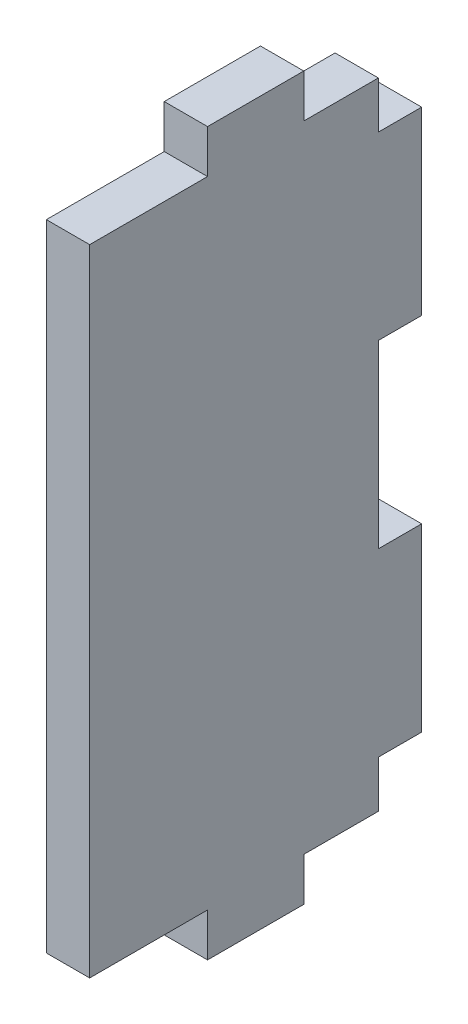
ISO-10303-21;
HEADER;
FILE_DESCRIPTION(('STEP AP214'),'2;1');
FILE_NAME('part.step','',(''),(''),'','','');
FILE_SCHEMA(('AUTOMOTIVE_DESIGN { 1 0 10303 214 1 1 1 1 }'));
ENDSEC;
DATA;
#1=APPLICATION_CONTEXT('core data for automotive mechanical design processes');
#2=APPLICATION_PROTOCOL_DEFINITION('international standard','automotive_design',2000,#1);
#3=PRODUCT_CONTEXT('',#1,'mechanical');
#4=PRODUCT('Part','Part','',(#3));
#5=PRODUCT_RELATED_PRODUCT_CATEGORY('part','',(#4));
#6=PRODUCT_DEFINITION_FORMATION('','',#4);
#7=PRODUCT_DEFINITION_CONTEXT('part definition',#1,'design');
#8=PRODUCT_DEFINITION('design','',#6,#7);
#9=PRODUCT_DEFINITION_SHAPE('','',#8);
#10=(LENGTH_UNIT() NAMED_UNIT(*) SI_UNIT(.MILLI.,.METRE.));
#11=(NAMED_UNIT(*) PLANE_ANGLE_UNIT() SI_UNIT($,.RADIAN.));
#12=(NAMED_UNIT(*) SI_UNIT($,.STERADIAN.) SOLID_ANGLE_UNIT());
#13=UNCERTAINTY_MEASURE_WITH_UNIT(LENGTH_MEASURE(1.E-05),#10,'distance_accuracy_value','');
#14=(GEOMETRIC_REPRESENTATION_CONTEXT(3) GLOBAL_UNCERTAINTY_ASSIGNED_CONTEXT((#13)) GLOBAL_UNIT_ASSIGNED_CONTEXT((#10,
#11,#12)) REPRESENTATION_CONTEXT('',''));
#15=CARTESIAN_POINT('',(0.,0.,0.));
#16=DIRECTION('',(0.,0.,1.));
#17=DIRECTION('',(1.,0.,0.));
#18=AXIS2_PLACEMENT_3D('',#15,#16,#17);
#19=CARTESIAN_POINT('',(0.,75.,69.));
#20=DIRECTION('',(0.,-1.,0.));
#21=DIRECTION('',(0.,0.,-1.));
#22=AXIS2_PLACEMENT_3D('',#19,#20,#21);
#23=PLANE('',#22);
#24=DIRECTION('',(0.,0.,-1.));
#25=VECTOR('',#24,1.);
#26=CARTESIAN_POINT('',(140.,75.,69.));
#27=LINE('',#26,#25);
#28=CARTESIAN_POINT('',(140.,75.,44.5));
#29=VERTEX_POINT('',#28);
#30=CARTESIAN_POINT('',(140.,75.,24.5));
#31=VERTEX_POINT('',#30);
#32=EDGE_CURVE('E188',#29,#31,#27,.T.);
#33=ORIENTED_EDGE('',*,*,#32,.T.);
#34=DIRECTION('',(1.,0.,0.));
#35=VECTOR('',#34,1.);
#36=CARTESIAN_POINT('',(-250.,75.,24.5));
#37=LINE('',#36,#35);
#38=CARTESIAN_POINT('',(131.,75.,24.5));
#39=VERTEX_POINT('',#38);
#40=EDGE_CURVE('E253',#39,#31,#37,.T.);
#41=ORIENTED_EDGE('',*,*,#40,.F.);
#42=DIRECTION('',(0.,0.,-1.));
#43=VECTOR('',#42,1.);
#44=CARTESIAN_POINT('',(131.,75.,69.));
#45=LINE('',#44,#43);
#46=CARTESIAN_POINT('',(131.,75.,44.5));
#47=VERTEX_POINT('',#46);
#48=EDGE_CURVE('E190',#47,#39,#45,.T.);
#49=ORIENTED_EDGE('',*,*,#48,.F.);
#50=DIRECTION('',(1.,0.,0.));
#51=VECTOR('',#50,1.);
#52=CARTESIAN_POINT('',(-250.,75.,44.5));
#53=LINE('',#52,#51);
#54=EDGE_CURVE('E175',#47,#29,#53,.T.);
#55=ORIENTED_EDGE('',*,*,#54,.T.);
#56=EDGE_LOOP('',(#33,#41,#49,#55));
#57=FACE_BOUND('',#56,.T.);
#58=ADVANCED_FACE('F35',(#57),#23,.F.);
#59=CARTESIAN_POINT('',(140.,0.,69.));
#60=DIRECTION('',(1.,0.,0.));
#61=DIRECTION('',(0.,0.,1.));
#62=AXIS2_PLACEMENT_3D('',#59,#60,#61);
#63=PLANE('',#62);
#64=DIRECTION('',(0.,1.,0.));
#65=VECTOR('',#64,1.);
#66=CARTESIAN_POINT('',(140.,0.,9.));
#67=LINE('',#66,#65);
#68=CARTESIAN_POINT('',(140.,-66.,9.));
#69=VERTEX_POINT('',#68);
#70=CARTESIAN_POINT('',(140.,-56.25,9.));
#71=VERTEX_POINT('',#70);
#72=EDGE_CURVE('E325',#69,#71,#67,.T.);
#73=ORIENTED_EDGE('',*,*,#72,.T.);
#74=DIRECTION('',(0.,0.,-1.));
#75=VECTOR('',#74,1.);
#76=CARTESIAN_POINT('',(140.,-56.25,47.5648803965473));
#77=LINE('',#76,#75);
#78=CARTESIAN_POINT('',(140.,-56.25,0.));
#79=VERTEX_POINT('',#78);
#80=EDGE_CURVE('E288',#71,#79,#77,.T.);
#81=ORIENTED_EDGE('',*,*,#80,.T.);
#82=DIRECTION('',(0.,-1.,0.));
#83=VECTOR('',#82,1.);
#84=CARTESIAN_POINT('',(140.,0.,0.));
#85=LINE('',#84,#83);
#86=CARTESIAN_POINT('',(140.,-18.75,0.));
#87=VERTEX_POINT('',#86);
#88=EDGE_CURVE('E274',#87,#79,#85,.T.);
#89=ORIENTED_EDGE('',*,*,#88,.F.);
#90=DIRECTION('',(0.,0.,-1.));
#91=VECTOR('',#90,1.);
#92=CARTESIAN_POINT('',(140.,-18.75,47.5648803965473));
#93=LINE('',#92,#91);
#94=CARTESIAN_POINT('',(140.,-18.75,9.));
#95=VERTEX_POINT('',#94);
#96=EDGE_CURVE('E270',#95,#87,#93,.T.);
#97=ORIENTED_EDGE('',*,*,#96,.F.);
#98=CARTESIAN_POINT('',(140.,18.75,9.00000000000001));
#99=VERTEX_POINT('',#98);
#100=EDGE_CURVE('E328',#95,#99,#67,.T.);
#101=ORIENTED_EDGE('',*,*,#100,.T.);
#102=DIRECTION('',(0.,0.,-1.));
#103=VECTOR('',#102,1.);
#104=CARTESIAN_POINT('',(140.,18.75,47.5648803965473));
#105=LINE('',#104,#103);
#106=CARTESIAN_POINT('',(140.,18.75,0.));
#107=VERTEX_POINT('',#106);
#108=EDGE_CURVE('E309',#99,#107,#105,.T.);
#109=ORIENTED_EDGE('',*,*,#108,.T.);
#110=DIRECTION('',(0.,-1.,0.));
#111=VECTOR('',#110,1.);
#112=CARTESIAN_POINT('',(140.,0.,0.));
#113=LINE('',#112,#111);
#114=CARTESIAN_POINT('',(140.,56.25,0.));
#115=VERTEX_POINT('',#114);
#116=EDGE_CURVE('E301',#115,#107,#113,.T.);
#117=ORIENTED_EDGE('',*,*,#116,.F.);
#118=DIRECTION('',(0.,0.,-1.));
#119=VECTOR('',#118,1.);
#120=CARTESIAN_POINT('',(140.,56.25,47.5648803965473));
#121=LINE('',#120,#119);
#122=CARTESIAN_POINT('',(140.,56.25,9.));
#123=VERTEX_POINT('',#122);
#124=EDGE_CURVE('E312',#123,#115,#121,.T.);
#125=ORIENTED_EDGE('',*,*,#124,.F.);
#126=CARTESIAN_POINT('',(140.,66.,9.));
#127=VERTEX_POINT('',#126);
#128=EDGE_CURVE('E295',#123,#127,#67,.T.);
#129=ORIENTED_EDGE('',*,*,#128,.T.);
#130=DIRECTION('',(0.,0.,1.));
#131=VECTOR('',#130,1.);
#132=CARTESIAN_POINT('',(140.,66.,0.));
#133=LINE('',#132,#131);
#134=CARTESIAN_POINT('',(140.,66.,24.5));
#135=VERTEX_POINT('',#134);
#136=EDGE_CURVE('E251',#127,#135,#133,.T.);
#137=ORIENTED_EDGE('',*,*,#136,.T.);
#138=DIRECTION('',(0.,-1.,0.));
#139=VECTOR('',#138,1.);
#140=CARTESIAN_POINT('',(140.,0.,24.5));
#141=LINE('',#140,#139);
#142=EDGE_CURVE('E195',#31,#135,#141,.T.);
#143=ORIENTED_EDGE('',*,*,#142,.F.);
#144=ORIENTED_EDGE('',*,*,#32,.F.);
#145=DIRECTION('',(0.,-1.,0.));
#146=VECTOR('',#145,1.);
#147=CARTESIAN_POINT('',(140.,0.,44.5));
#148=LINE('',#147,#146);
#149=CARTESIAN_POINT('',(140.,66.,44.5));
#150=VERTEX_POINT('',#149);
#151=EDGE_CURVE('E171',#29,#150,#148,.T.);
#152=ORIENTED_EDGE('',*,*,#151,.T.);
#153=DIRECTION('',(0.,0.,1.));
#154=VECTOR('',#153,1.);
#155=CARTESIAN_POINT('',(140.,66.,0.));
#156=LINE('',#155,#154);
#157=CARTESIAN_POINT('',(140.,66.,69.));
#158=VERTEX_POINT('',#157);
#159=EDGE_CURVE('E182',#150,#158,#156,.T.);
#160=ORIENTED_EDGE('',*,*,#159,.T.);
#161=DIRECTION('',(0.,1.,0.));
#162=VECTOR('',#161,1.);
#163=CARTESIAN_POINT('',(140.,0.,69.));
#164=LINE('',#163,#162);
#165=CARTESIAN_POINT('',(140.,-66.,69.));
#166=VERTEX_POINT('',#165);
#167=EDGE_CURVE('E319',#166,#158,#164,.T.);
#168=ORIENTED_EDGE('',*,*,#167,.F.);
#169=DIRECTION('',(0.,0.,1.));
#170=VECTOR('',#169,1.);
#171=CARTESIAN_POINT('',(140.,-66.,0.));
#172=LINE('',#171,#170);
#173=CARTESIAN_POINT('',(140.,-66.,44.5));
#174=VERTEX_POINT('',#173);
#175=EDGE_CURVE('E248',#174,#166,#172,.T.);
#176=ORIENTED_EDGE('',*,*,#175,.F.);
#177=DIRECTION('',(0.,1.,0.));
#178=VECTOR('',#177,1.);
#179=CARTESIAN_POINT('',(140.,0.,44.5));
#180=LINE('',#179,#178);
#181=CARTESIAN_POINT('',(140.,-75.,44.5));
#182=VERTEX_POINT('',#181);
#183=EDGE_CURVE('E234',#182,#174,#180,.T.);
#184=ORIENTED_EDGE('',*,*,#183,.F.);
#185=DIRECTION('',(0.,0.,-1.));
#186=VECTOR('',#185,1.);
#187=CARTESIAN_POINT('',(140.,-75.,69.));
#188=LINE('',#187,#186);
#189=CARTESIAN_POINT('',(140.,-75.,24.5));
#190=VERTEX_POINT('',#189);
#191=EDGE_CURVE('E198',#182,#190,#188,.T.);
#192=ORIENTED_EDGE('',*,*,#191,.T.);
#193=DIRECTION('',(0.,1.,0.));
#194=VECTOR('',#193,1.);
#195=CARTESIAN_POINT('',(140.,0.,24.5));
#196=LINE('',#195,#194);
#197=CARTESIAN_POINT('',(140.,-66.,24.5));
#198=VERTEX_POINT('',#197);
#199=EDGE_CURVE('E239',#190,#198,#196,.T.);
#200=ORIENTED_EDGE('',*,*,#199,.T.);
#201=DIRECTION('',(0.,0.,1.));
#202=VECTOR('',#201,1.);
#203=CARTESIAN_POINT('',(140.,-66.,0.));
#204=LINE('',#203,#202);
#205=EDGE_CURVE('E242',#69,#198,#204,.T.);
#206=ORIENTED_EDGE('',*,*,#205,.F.);
#207=EDGE_LOOP('',(#73,#81,#89,#97,#101,#109,#117,#125,#129,#137,#143,#144,#152,#160,#168,#176,
#184,#192,#200,#206));
#208=FACE_BOUND('',#207,.T.);
#209=ADVANCED_FACE('F193',(#208),#63,.T.);
#210=CARTESIAN_POINT('',(0.,-75.,69.));
#211=DIRECTION('',(0.,-1.,0.));
#212=DIRECTION('',(0.,0.,-1.));
#213=AXIS2_PLACEMENT_3D('',#210,#211,#212);
#214=PLANE('',#213);
#215=DIRECTION('',(1.,0.,0.));
#216=VECTOR('',#215,1.);
#217=CARTESIAN_POINT('',(-250.,-75.,24.5));
#218=LINE('',#217,#216);
#219=CARTESIAN_POINT('',(131.,-75.,24.5));
#220=VERTEX_POINT('',#219);
#221=EDGE_CURVE('E245',#220,#190,#218,.T.);
#222=ORIENTED_EDGE('',*,*,#221,.T.);
#223=ORIENTED_EDGE('',*,*,#191,.F.);
#224=DIRECTION('',(1.,0.,0.));
#225=VECTOR('',#224,1.);
#226=CARTESIAN_POINT('',(-250.,-75.,44.5));
#227=LINE('',#226,#225);
#228=CARTESIAN_POINT('',(131.,-75.,44.5));
#229=VERTEX_POINT('',#228);
#230=EDGE_CURVE('E183',#229,#182,#227,.T.);
#231=ORIENTED_EDGE('',*,*,#230,.F.);
#232=DIRECTION('',(0.,0.,-1.));
#233=VECTOR('',#232,1.);
#234=CARTESIAN_POINT('',(131.,-75.,69.));
#235=LINE('',#234,#233);
#236=EDGE_CURVE('E203',#229,#220,#235,.T.);
#237=ORIENTED_EDGE('',*,*,#236,.T.);
#238=EDGE_LOOP('',(#222,#223,#231,#237));
#239=FACE_BOUND('',#238,.T.);
#240=ADVANCED_FACE('F231',(#239),#214,.T.);
#241=CARTESIAN_POINT('',(131.,0.,69.));
#242=DIRECTION('',(-1.,0.,0.));
#243=DIRECTION('',(0.,0.,-1.));
#244=AXIS2_PLACEMENT_3D('',#241,#242,#243);
#245=PLANE('',#244);
#246=DIRECTION('',(0.,-1.,0.));
#247=VECTOR('',#246,1.);
#248=CARTESIAN_POINT('',(131.,0.,24.5));
#249=LINE('',#248,#247);
#250=CARTESIAN_POINT('',(131.,-66.,24.5));
#251=VERTEX_POINT('',#250);
#252=EDGE_CURVE('E11',#251,#220,#249,.T.);
#253=ORIENTED_EDGE('',*,*,#252,.T.);
#254=ORIENTED_EDGE('',*,*,#236,.F.);
#255=DIRECTION('',(0.,-1.,0.));
#256=VECTOR('',#255,1.);
#257=CARTESIAN_POINT('',(131.,0.,44.5));
#258=LINE('',#257,#256);
#259=CARTESIAN_POINT('',(131.,-66.,44.5));
#260=VERTEX_POINT('',#259);
#261=EDGE_CURVE('E42',#260,#229,#258,.T.);
#262=ORIENTED_EDGE('',*,*,#261,.F.);
#263=DIRECTION('',(0.,0.,-1.));
#264=VECTOR('',#263,1.);
#265=CARTESIAN_POINT('',(131.,-66.,68.9999999999999));
#266=LINE('',#265,#264);
#267=CARTESIAN_POINT('',(131.,-66.,69.));
#268=VERTEX_POINT('',#267);
#269=EDGE_CURVE('E262',#268,#260,#266,.T.);
#270=ORIENTED_EDGE('',*,*,#269,.F.);
#271=DIRECTION('',(0.,-1.,0.));
#272=VECTOR('',#271,1.);
#273=CARTESIAN_POINT('',(131.,0.,69.));
#274=LINE('',#273,#272);
#275=CARTESIAN_POINT('',(131.,66.,69.));
#276=VERTEX_POINT('',#275);
#277=EDGE_CURVE('E322',#276,#268,#274,.T.);
#278=ORIENTED_EDGE('',*,*,#277,.F.);
#279=DIRECTION('',(0.,0.,-1.));
#280=VECTOR('',#279,1.);
#281=CARTESIAN_POINT('',(131.,66.,69.));
#282=LINE('',#281,#280);
#283=CARTESIAN_POINT('',(131.,66.,44.5));
#284=VERTEX_POINT('',#283);
#285=EDGE_CURVE('E259',#276,#284,#282,.T.);
#286=ORIENTED_EDGE('',*,*,#285,.T.);
#287=DIRECTION('',(0.,1.,0.));
#288=VECTOR('',#287,1.);
#289=CARTESIAN_POINT('',(131.,0.,44.5));
#290=LINE('',#289,#288);
#291=EDGE_CURVE('E214',#284,#47,#290,.T.);
#292=ORIENTED_EDGE('',*,*,#291,.T.);
#293=ORIENTED_EDGE('',*,*,#48,.T.);
#294=DIRECTION('',(0.,1.,0.));
#295=VECTOR('',#294,1.);
#296=CARTESIAN_POINT('',(131.,0.,24.5));
#297=LINE('',#296,#295);
#298=CARTESIAN_POINT('',(131.,66.,24.5));
#299=VERTEX_POINT('',#298);
#300=EDGE_CURVE('E212',#299,#39,#297,.T.);
#301=ORIENTED_EDGE('',*,*,#300,.F.);
#302=DIRECTION('',(0.,0.,-1.));
#303=VECTOR('',#302,1.);
#304=CARTESIAN_POINT('',(131.,66.,69.));
#305=LINE('',#304,#303);
#306=CARTESIAN_POINT('',(131.,66.,9.));
#307=VERTEX_POINT('',#306);
#308=EDGE_CURVE('E209',#299,#307,#305,.T.);
#309=ORIENTED_EDGE('',*,*,#308,.T.);
#310=DIRECTION('',(0.,-1.,0.));
#311=VECTOR('',#310,1.);
#312=CARTESIAN_POINT('',(131.,0.,9.));
#313=LINE('',#312,#311);
#314=CARTESIAN_POINT('',(131.,56.25,9.));
#315=VERTEX_POINT('',#314);
#316=EDGE_CURVE('E323',#307,#315,#313,.T.);
#317=ORIENTED_EDGE('',*,*,#316,.T.);
#318=DIRECTION('',(0.,0.,-1.));
#319=VECTOR('',#318,1.);
#320=CARTESIAN_POINT('',(131.,56.25,47.5648803965473));
#321=LINE('',#320,#319);
#322=CARTESIAN_POINT('',(131.,56.25,0.));
#323=VERTEX_POINT('',#322);
#324=EDGE_CURVE('E315',#315,#323,#321,.T.);
#325=ORIENTED_EDGE('',*,*,#324,.T.);
#326=DIRECTION('',(0.,-1.,0.));
#327=VECTOR('',#326,1.);
#328=CARTESIAN_POINT('',(131.,0.,0.));
#329=LINE('',#328,#327);
#330=CARTESIAN_POINT('',(131.,18.75,0.));
#331=VERTEX_POINT('',#330);
#332=EDGE_CURVE('E272',#323,#331,#329,.T.);
#333=ORIENTED_EDGE('',*,*,#332,.T.);
#334=DIRECTION('',(0.,0.,-1.));
#335=VECTOR('',#334,1.);
#336=CARTESIAN_POINT('',(131.,18.75,47.5648803965473));
#337=LINE('',#336,#335);
#338=CARTESIAN_POINT('',(131.,18.75,9.));
#339=VERTEX_POINT('',#338);
#340=EDGE_CURVE('E306',#339,#331,#337,.T.);
#341=ORIENTED_EDGE('',*,*,#340,.F.);
#342=CARTESIAN_POINT('',(131.,-18.75,9.));
#343=VERTEX_POINT('',#342);
#344=EDGE_CURVE('E331',#339,#343,#313,.T.);
#345=ORIENTED_EDGE('',*,*,#344,.T.);
#346=DIRECTION('',(0.,0.,-1.));
#347=VECTOR('',#346,1.);
#348=CARTESIAN_POINT('',(131.,-18.75,47.5648803965473));
#349=LINE('',#348,#347);
#350=CARTESIAN_POINT('',(131.,-18.75,0.));
#351=VERTEX_POINT('',#350);
#352=EDGE_CURVE('E282',#343,#351,#349,.T.);
#353=ORIENTED_EDGE('',*,*,#352,.T.);
#354=DIRECTION('',(0.,-1.,0.));
#355=VECTOR('',#354,1.);
#356=CARTESIAN_POINT('',(131.,0.,0.));
#357=LINE('',#356,#355);
#358=CARTESIAN_POINT('',(131.,-56.25,0.));
#359=VERTEX_POINT('',#358);
#360=EDGE_CURVE('E279',#351,#359,#357,.T.);
#361=ORIENTED_EDGE('',*,*,#360,.T.);
#362=DIRECTION('',(0.,0.,-1.));
#363=VECTOR('',#362,1.);
#364=CARTESIAN_POINT('',(131.,-56.25,47.5648803965473));
#365=LINE('',#364,#363);
#366=CARTESIAN_POINT('',(131.,-56.25,9.00000000000001));
#367=VERTEX_POINT('',#366);
#368=EDGE_CURVE('E285',#367,#359,#365,.T.);
#369=ORIENTED_EDGE('',*,*,#368,.F.);
#370=CARTESIAN_POINT('',(131.,-66.,9.));
#371=VERTEX_POINT('',#370);
#372=EDGE_CURVE('E327',#367,#371,#313,.T.);
#373=ORIENTED_EDGE('',*,*,#372,.T.);
#374=DIRECTION('',(0.,0.,-1.));
#375=VECTOR('',#374,1.);
#376=CARTESIAN_POINT('',(131.,-66.,69.));
#377=LINE('',#376,#375);
#378=EDGE_CURVE('E255',#251,#371,#377,.T.);
#379=ORIENTED_EDGE('',*,*,#378,.F.);
#380=EDGE_LOOP('',(#253,#254,#262,#270,#278,#286,#292,#293,#301,#309,#317,#325,#333,#341,#345,
#353,#361,#369,#373,#379));
#381=FACE_BOUND('',#380,.T.);
#382=ADVANCED_FACE('F226',(#381),#245,.T.);
#383=CARTESIAN_POINT('',(0.,0.,69.));
#384=DIRECTION('',(0.,0.,-1.));
#385=DIRECTION('',(1.,0.,0.));
#386=AXIS2_PLACEMENT_3D('',#383,#384,#385);
#387=PLANE('',#386);
#388=DIRECTION('',(1.,0.,0.));
#389=VECTOR('',#388,1.);
#390=CARTESIAN_POINT('',(0.,-66.,69.));
#391=LINE('',#390,#389);
#392=EDGE_CURVE('E57',#268,#166,#391,.T.);
#393=ORIENTED_EDGE('',*,*,#392,.T.);
#394=ORIENTED_EDGE('',*,*,#167,.T.);
#395=DIRECTION('',(1.,0.,0.));
#396=VECTOR('',#395,1.);
#397=CARTESIAN_POINT('',(0.,66.,69.));
#398=LINE('',#397,#396);
#399=EDGE_CURVE('E200',#276,#158,#398,.T.);
#400=ORIENTED_EDGE('',*,*,#399,.F.);
#401=ORIENTED_EDGE('',*,*,#277,.T.);
#402=EDGE_LOOP('',(#393,#394,#400,#401));
#403=FACE_BOUND('',#402,.T.);
#404=ADVANCED_FACE('F383',(#403),#387,.F.);
#405=CARTESIAN_POINT('',(0.,0.,9.));
#406=DIRECTION('',(0.,0.,-1.));
#407=DIRECTION('',(1.,0.,0.));
#408=AXIS2_PLACEMENT_3D('',#405,#406,#407);
#409=PLANE('',#408);
#410=ORIENTED_EDGE('',*,*,#372,.F.);
#411=DIRECTION('',(-1.,0.,0.));
#412=VECTOR('',#411,1.);
#413=CARTESIAN_POINT('',(0.,-56.25,9.));
#414=LINE('',#413,#412);
#415=EDGE_CURVE('E267',#71,#367,#414,.T.);
#416=ORIENTED_EDGE('',*,*,#415,.F.);
#417=ORIENTED_EDGE('',*,*,#72,.F.);
#418=DIRECTION('',(1.,0.,0.));
#419=VECTOR('',#418,1.);
#420=CARTESIAN_POINT('',(0.,-66.,9.));
#421=LINE('',#420,#419);
#422=EDGE_CURVE('E197',#371,#69,#421,.T.);
#423=ORIENTED_EDGE('',*,*,#422,.F.);
#424=EDGE_LOOP('',(#410,#416,#417,#423));
#425=FACE_BOUND('',#424,.T.);
#426=ADVANCED_FACE('F365',(#425),#409,.T.);
#427=DIRECTION('',(1.,0.,0.));
#428=VECTOR('',#427,1.);
#429=CARTESIAN_POINT('',(0.,-18.75,9.));
#430=LINE('',#429,#428);
#431=EDGE_CURVE('E269',#343,#95,#430,.T.);
#432=ORIENTED_EDGE('',*,*,#431,.F.);
#433=ORIENTED_EDGE('',*,*,#344,.F.);
#434=DIRECTION('',(1.,0.,0.));
#435=VECTOR('',#434,1.);
#436=CARTESIAN_POINT('',(0.,18.75,9.));
#437=LINE('',#436,#435);
#438=EDGE_CURVE('E296',#339,#99,#437,.T.);
#439=ORIENTED_EDGE('',*,*,#438,.T.);
#440=ORIENTED_EDGE('',*,*,#100,.F.);
#441=EDGE_LOOP('',(#432,#433,#439,#440));
#442=FACE_BOUND('',#441,.T.);
#443=ADVANCED_FACE('F359',(#442),#409,.T.);
#444=DIRECTION('',(1.,0.,0.));
#445=VECTOR('',#444,1.);
#446=CARTESIAN_POINT('',(0.,66.,9.));
#447=LINE('',#446,#445);
#448=EDGE_CURVE('E264',#307,#127,#447,.T.);
#449=ORIENTED_EDGE('',*,*,#448,.T.);
#450=ORIENTED_EDGE('',*,*,#128,.F.);
#451=DIRECTION('',(-1.,0.,0.));
#452=VECTOR('',#451,1.);
#453=CARTESIAN_POINT('',(0.,56.25,9.));
#454=LINE('',#453,#452);
#455=EDGE_CURVE('E293',#123,#315,#454,.T.);
#456=ORIENTED_EDGE('',*,*,#455,.T.);
#457=ORIENTED_EDGE('',*,*,#316,.F.);
#458=EDGE_LOOP('',(#449,#450,#456,#457));
#459=FACE_BOUND('',#458,.T.);
#460=ADVANCED_FACE('F343',(#459),#409,.T.);
#461=CARTESIAN_POINT('',(0.,0.,0.));
#462=DIRECTION('',(0.,0.,1.));
#463=DIRECTION('',(-1.,0.,0.));
#464=AXIS2_PLACEMENT_3D('',#461,#462,#463);
#465=PLANE('',#464);
#466=ORIENTED_EDGE('',*,*,#332,.F.);
#467=DIRECTION('',(1.,0.,0.));
#468=VECTOR('',#467,1.);
#469=CARTESIAN_POINT('',(0.,56.25,0.));
#470=LINE('',#469,#468);
#471=EDGE_CURVE('E299',#323,#115,#470,.T.);
#472=ORIENTED_EDGE('',*,*,#471,.T.);
#473=ORIENTED_EDGE('',*,*,#116,.T.);
#474=DIRECTION('',(-1.,0.,0.));
#475=VECTOR('',#474,1.);
#476=CARTESIAN_POINT('',(0.,18.75,0.));
#477=LINE('',#476,#475);
#478=EDGE_CURVE('E304',#107,#331,#477,.T.);
#479=ORIENTED_EDGE('',*,*,#478,.T.);
#480=EDGE_LOOP('',(#466,#472,#473,#479));
#481=FACE_BOUND('',#480,.T.);
#482=ADVANCED_FACE('F349',(#481),#465,.F.);
#483=CARTESIAN_POINT('',(0.,18.75,47.5648803965473));
#484=DIRECTION('',(0.,1.,0.));
#485=DIRECTION('',(0.,0.,1.));
#486=AXIS2_PLACEMENT_3D('',#483,#484,#485);
#487=PLANE('',#486);
#488=ORIENTED_EDGE('',*,*,#340,.T.);
#489=ORIENTED_EDGE('',*,*,#478,.F.);
#490=ORIENTED_EDGE('',*,*,#108,.F.);
#491=ORIENTED_EDGE('',*,*,#438,.F.);
#492=EDGE_LOOP('',(#488,#489,#490,#491));
#493=FACE_BOUND('',#492,.T.);
#494=ADVANCED_FACE('F354',(#493),#487,.F.);
#495=CARTESIAN_POINT('',(0.,56.25,47.5648803965473));
#496=DIRECTION('',(0.,-1.,0.));
#497=DIRECTION('',(0.,0.,-1.));
#498=AXIS2_PLACEMENT_3D('',#495,#496,#497);
#499=PLANE('',#498);
#500=ORIENTED_EDGE('',*,*,#124,.T.);
#501=ORIENTED_EDGE('',*,*,#471,.F.);
#502=ORIENTED_EDGE('',*,*,#324,.F.);
#503=ORIENTED_EDGE('',*,*,#455,.F.);
#504=EDGE_LOOP('',(#500,#501,#502,#503));
#505=FACE_BOUND('',#504,.T.);
#506=ADVANCED_FACE('F345',(#505),#499,.F.);
#507=CARTESIAN_POINT('',(0.,-18.75,47.5648803965473));
#508=DIRECTION('',(0.,1.,0.));
#509=DIRECTION('',(0.,0.,1.));
#510=AXIS2_PLACEMENT_3D('',#507,#508,#509);
#511=PLANE('',#510);
#512=ORIENTED_EDGE('',*,*,#431,.T.);
#513=ORIENTED_EDGE('',*,*,#96,.T.);
#514=DIRECTION('',(-1.,0.,0.));
#515=VECTOR('',#514,1.);
#516=CARTESIAN_POINT('',(0.,-18.75,0.));
#517=LINE('',#516,#515);
#518=EDGE_CURVE('E266',#87,#351,#517,.T.);
#519=ORIENTED_EDGE('',*,*,#518,.T.);
#520=ORIENTED_EDGE('',*,*,#352,.F.);
#521=EDGE_LOOP('',(#512,#513,#519,#520));
#522=FACE_BOUND('',#521,.T.);
#523=ADVANCED_FACE('F411',(#522),#511,.T.);
#524=CARTESIAN_POINT('',(0.,-56.25,47.5648803965473));
#525=DIRECTION('',(0.,-1.,0.));
#526=DIRECTION('',(0.,0.,-1.));
#527=AXIS2_PLACEMENT_3D('',#524,#525,#526);
#528=PLANE('',#527);
#529=ORIENTED_EDGE('',*,*,#415,.T.);
#530=ORIENTED_EDGE('',*,*,#368,.T.);
#531=DIRECTION('',(1.,0.,0.));
#532=VECTOR('',#531,1.);
#533=CARTESIAN_POINT('',(0.,-56.25,0.));
#534=LINE('',#533,#532);
#535=EDGE_CURVE('E277',#359,#79,#534,.T.);
#536=ORIENTED_EDGE('',*,*,#535,.T.);
#537=ORIENTED_EDGE('',*,*,#80,.F.);
#538=EDGE_LOOP('',(#529,#530,#536,#537));
#539=FACE_BOUND('',#538,.T.);
#540=ADVANCED_FACE('F418',(#539),#528,.T.);
#541=CARTESIAN_POINT('',(0.,0.,0.));
#542=DIRECTION('',(0.,0.,1.));
#543=DIRECTION('',(-1.,0.,0.));
#544=AXIS2_PLACEMENT_3D('',#541,#542,#543);
#545=PLANE('',#544);
#546=ORIENTED_EDGE('',*,*,#518,.F.);
#547=ORIENTED_EDGE('',*,*,#88,.T.);
#548=ORIENTED_EDGE('',*,*,#535,.F.);
#549=ORIENTED_EDGE('',*,*,#360,.F.);
#550=EDGE_LOOP('',(#546,#547,#548,#549));
#551=FACE_BOUND('',#550,.T.);
#552=ADVANCED_FACE('F422',(#551),#545,.F.);
#553=CARTESIAN_POINT('',(-250.,-66.,0.));
#554=DIRECTION('',(0.,-1.,0.));
#555=DIRECTION('',(0.,0.,-1.));
#556=AXIS2_PLACEMENT_3D('',#553,#554,#555);
#557=PLANE('',#556);
#558=DIRECTION('',(1.,0.,0.));
#559=VECTOR('',#558,1.);
#560=CARTESIAN_POINT('',(-250.,-66.,24.5));
#561=LINE('',#560,#559);
#562=EDGE_CURVE('E246',#251,#198,#561,.T.);
#563=ORIENTED_EDGE('',*,*,#562,.F.);
#564=ORIENTED_EDGE('',*,*,#378,.T.);
#565=ORIENTED_EDGE('',*,*,#422,.T.);
#566=ORIENTED_EDGE('',*,*,#205,.T.);
#567=EDGE_LOOP('',(#563,#564,#565,#566));
#568=FACE_BOUND('',#567,.T.);
#569=ADVANCED_FACE('F370',(#568),#557,.T.);
#570=CARTESIAN_POINT('',(-250.,0.,24.5));
#571=DIRECTION('',(0.,0.,1.));
#572=DIRECTION('',(0.,-1.,0.));
#573=AXIS2_PLACEMENT_3D('',#570,#571,#572);
#574=PLANE('',#573);
#575=ORIENTED_EDGE('',*,*,#252,.F.);
#576=ORIENTED_EDGE('',*,*,#562,.T.);
#577=ORIENTED_EDGE('',*,*,#199,.F.);
#578=ORIENTED_EDGE('',*,*,#221,.F.);
#579=EDGE_LOOP('',(#575,#576,#577,#578));
#580=FACE_BOUND('',#579,.T.);
#581=ADVANCED_FACE('F373',(#580),#574,.F.);
#582=CARTESIAN_POINT('',(-250.,66.,0.));
#583=DIRECTION('',(0.,-1.,0.));
#584=DIRECTION('',(0.,0.,-1.));
#585=AXIS2_PLACEMENT_3D('',#582,#583,#584);
#586=PLANE('',#585);
#587=ORIENTED_EDGE('',*,*,#285,.F.);
#588=ORIENTED_EDGE('',*,*,#399,.T.);
#589=ORIENTED_EDGE('',*,*,#159,.F.);
#590=DIRECTION('',(1.,0.,0.));
#591=VECTOR('',#590,1.);
#592=CARTESIAN_POINT('',(-250.,66.,44.5));
#593=LINE('',#592,#591);
#594=EDGE_CURVE('E177',#284,#150,#593,.T.);
#595=ORIENTED_EDGE('',*,*,#594,.F.);
#596=EDGE_LOOP('',(#587,#588,#589,#595));
#597=FACE_BOUND('',#596,.T.);
#598=ADVANCED_FACE('F380',(#597),#586,.F.);
#599=CARTESIAN_POINT('',(-250.,0.,44.5));
#600=DIRECTION('',(0.,0.,-1.));
#601=DIRECTION('',(1.,0.,0.));
#602=AXIS2_PLACEMENT_3D('',#599,#600,#601);
#603=PLANE('',#602);
#604=ORIENTED_EDGE('',*,*,#291,.F.);
#605=ORIENTED_EDGE('',*,*,#594,.T.);
#606=ORIENTED_EDGE('',*,*,#151,.F.);
#607=ORIENTED_EDGE('',*,*,#54,.F.);
#608=EDGE_LOOP('',(#604,#605,#606,#607));
#609=FACE_BOUND('',#608,.T.);
#610=ADVANCED_FACE('F174',(#609),#603,.F.);
#611=CARTESIAN_POINT('',(-250.,-66.,0.));
#612=DIRECTION('',(0.,-1.,0.));
#613=DIRECTION('',(0.,0.,-1.));
#614=AXIS2_PLACEMENT_3D('',#611,#612,#613);
#615=PLANE('',#614);
#616=ORIENTED_EDGE('',*,*,#392,.F.);
#617=ORIENTED_EDGE('',*,*,#269,.T.);
#618=DIRECTION('',(1.,0.,0.));
#619=VECTOR('',#618,1.);
#620=CARTESIAN_POINT('',(-250.,-66.,44.5));
#621=LINE('',#620,#619);
#622=EDGE_CURVE('E222',#260,#174,#621,.T.);
#623=ORIENTED_EDGE('',*,*,#622,.T.);
#624=ORIENTED_EDGE('',*,*,#175,.T.);
#625=EDGE_LOOP('',(#616,#617,#623,#624));
#626=FACE_BOUND('',#625,.T.);
#627=ADVANCED_FACE('F384',(#626),#615,.T.);
#628=CARTESIAN_POINT('',(-250.,0.,44.5));
#629=DIRECTION('',(0.,0.,1.));
#630=DIRECTION('',(-1.,0.,0.));
#631=AXIS2_PLACEMENT_3D('',#628,#629,#630);
#632=PLANE('',#631);
#633=ORIENTED_EDGE('',*,*,#622,.F.);
#634=ORIENTED_EDGE('',*,*,#261,.T.);
#635=ORIENTED_EDGE('',*,*,#230,.T.);
#636=ORIENTED_EDGE('',*,*,#183,.T.);
#637=EDGE_LOOP('',(#633,#634,#635,#636));
#638=FACE_BOUND('',#637,.T.);
#639=ADVANCED_FACE('F218',(#638),#632,.T.);
#640=CARTESIAN_POINT('',(-250.,0.,24.5));
#641=DIRECTION('',(0.,0.,-1.));
#642=DIRECTION('',(1.,0.,0.));
#643=AXIS2_PLACEMENT_3D('',#640,#641,#642);
#644=PLANE('',#643);
#645=DIRECTION('',(1.,0.,0.));
#646=VECTOR('',#645,1.);
#647=CARTESIAN_POINT('',(-250.,66.,24.5));
#648=LINE('',#647,#646);
#649=EDGE_CURVE('E49',#299,#135,#648,.T.);
#650=ORIENTED_EDGE('',*,*,#649,.F.);
#651=ORIENTED_EDGE('',*,*,#300,.T.);
#652=ORIENTED_EDGE('',*,*,#40,.T.);
#653=ORIENTED_EDGE('',*,*,#142,.T.);
#654=EDGE_LOOP('',(#650,#651,#652,#653));
#655=FACE_BOUND('',#654,.T.);
#656=ADVANCED_FACE('F333',(#655),#644,.T.);
#657=CARTESIAN_POINT('',(-250.,66.,0.));
#658=DIRECTION('',(0.,-1.,0.));
#659=DIRECTION('',(0.,0.,-1.));
#660=AXIS2_PLACEMENT_3D('',#657,#658,#659);
#661=PLANE('',#660);
#662=ORIENTED_EDGE('',*,*,#448,.F.);
#663=ORIENTED_EDGE('',*,*,#308,.F.);
#664=ORIENTED_EDGE('',*,*,#649,.T.);
#665=ORIENTED_EDGE('',*,*,#136,.F.);
#666=EDGE_LOOP('',(#662,#663,#664,#665));
#667=FACE_BOUND('',#666,.T.);
#668=ADVANCED_FACE('F339',(#667),#661,.F.);
#669=CLOSED_SHELL('',(#58,#209,#240,#382,#404,#426,#443,#460,#482,#494,#506,#523,#540,#552,#569,
#581,#598,#610,#627,#639,#656,#668));
#670=MANIFOLD_SOLID_BREP('B2',#669);
#671=ADVANCED_BREP_SHAPE_REPRESENTATION('',(#18,#670),#14);
#672=SHAPE_DEFINITION_REPRESENTATION(#9,#671);
ENDSEC;
END-ISO-10303-21;
